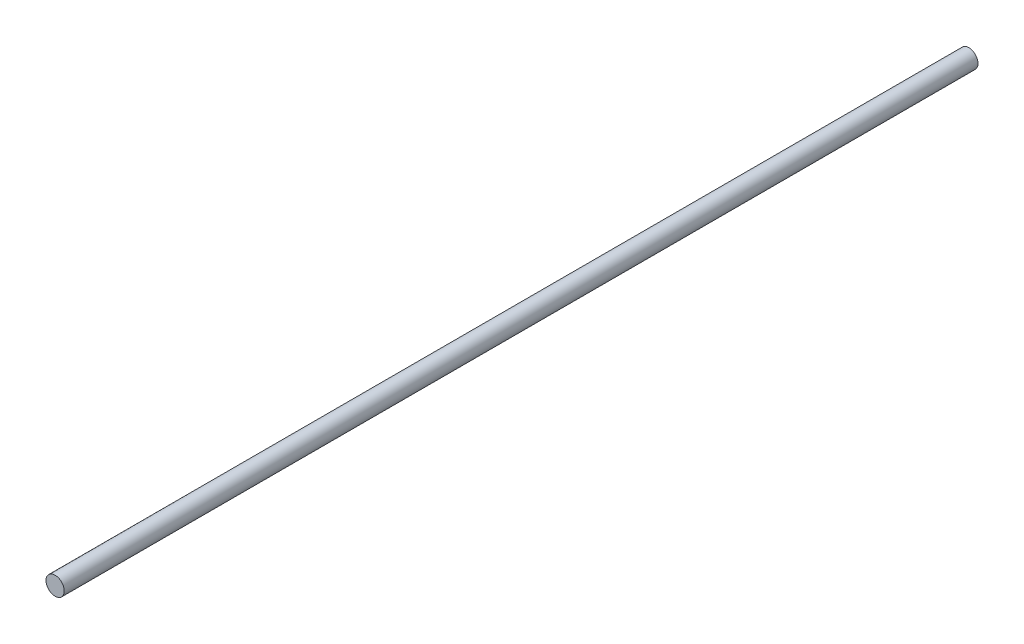
ISO-10303-21;
HEADER;
FILE_DESCRIPTION(('STEP AP214'),'2;1');
FILE_NAME('part.step','',(''),(''),'','','');
FILE_SCHEMA(('AUTOMOTIVE_DESIGN { 1 0 10303 214 1 1 1 1 }'));
ENDSEC;
DATA;
#1=APPLICATION_CONTEXT('core data for automotive mechanical design processes');
#2=APPLICATION_PROTOCOL_DEFINITION('international standard','automotive_design',2000,#1);
#3=PRODUCT_CONTEXT('',#1,'mechanical');
#4=PRODUCT('Part','Part','',(#3));
#5=PRODUCT_RELATED_PRODUCT_CATEGORY('part','',(#4));
#6=PRODUCT_DEFINITION_FORMATION('','',#4);
#7=PRODUCT_DEFINITION_CONTEXT('part definition',#1,'design');
#8=PRODUCT_DEFINITION('design','',#6,#7);
#9=PRODUCT_DEFINITION_SHAPE('','',#8);
#10=(LENGTH_UNIT() NAMED_UNIT(*) SI_UNIT(.MILLI.,.METRE.));
#11=(NAMED_UNIT(*) PLANE_ANGLE_UNIT() SI_UNIT($,.RADIAN.));
#12=(NAMED_UNIT(*) SI_UNIT($,.STERADIAN.) SOLID_ANGLE_UNIT());
#13=UNCERTAINTY_MEASURE_WITH_UNIT(LENGTH_MEASURE(1.E-05),#10,'distance_accuracy_value','');
#14=(GEOMETRIC_REPRESENTATION_CONTEXT(3) GLOBAL_UNCERTAINTY_ASSIGNED_CONTEXT((#13)) GLOBAL_UNIT_ASSIGNED_CONTEXT((#10,
#11,#12)) REPRESENTATION_CONTEXT('',''));
#15=CARTESIAN_POINT('',(0.,0.,0.));
#16=DIRECTION('',(0.,0.,1.));
#17=DIRECTION('',(1.,0.,0.));
#18=AXIS2_PLACEMENT_3D('',#15,#16,#17);
#19=CARTESIAN_POINT('',(0.,0.,150.));
#20=DIRECTION('',(0.,0.,-1.));
#21=DIRECTION('',(-1.,0.,0.));
#22=AXIS2_PLACEMENT_3D('',#19,#20,#21);
#23=CYLINDRICAL_SURFACE('',#22,1.5);
#24=CARTESIAN_POINT('',(0.,0.,150.));
#25=DIRECTION('',(0.,0.,1.));
#26=DIRECTION('',(1.,0.,0.));
#27=AXIS2_PLACEMENT_3D('',#24,#25,#26);
#28=CIRCLE('',#27,1.5);
#29=CARTESIAN_POINT('',(1.5,0.,150.));
#30=VERTEX_POINT('',#29);
#31=EDGE_CURVE('E10',#30,#30,#28,.T.);
#32=ORIENTED_EDGE('',*,*,#31,.F.);
#33=EDGE_LOOP('',(#32));
#34=FACE_BOUND('',#33,.T.);
#35=CARTESIAN_POINT('',(0.,0.,0.));
#36=DIRECTION('',(0.,0.,1.));
#37=DIRECTION('',(1.,0.,0.));
#38=AXIS2_PLACEMENT_3D('',#35,#36,#37);
#39=CIRCLE('',#38,1.5);
#40=CARTESIAN_POINT('',(1.5,0.,0.));
#41=VERTEX_POINT('',#40);
#42=EDGE_CURVE('E37',#41,#41,#39,.T.);
#43=ORIENTED_EDGE('',*,*,#42,.T.);
#44=EDGE_LOOP('',(#43));
#45=FACE_BOUND('',#44,.T.);
#46=ADVANCED_FACE('F34',(#34,#45),#23,.T.);
#47=CARTESIAN_POINT('',(0.,0.,150.));
#48=DIRECTION('',(0.,0.,1.));
#49=DIRECTION('',(1.,0.,0.));
#50=AXIS2_PLACEMENT_3D('',#47,#48,#49);
#51=PLANE('',#50);
#52=ORIENTED_EDGE('',*,*,#31,.T.);
#53=EDGE_LOOP('',(#52));
#54=FACE_BOUND('',#53,.T.);
#55=ADVANCED_FACE('F49',(#54),#51,.T.);
#56=CARTESIAN_POINT('',(0.,0.,0.));
#57=DIRECTION('',(0.,0.,1.));
#58=DIRECTION('',(1.,0.,0.));
#59=AXIS2_PLACEMENT_3D('',#56,#57,#58);
#60=PLANE('',#59);
#61=ORIENTED_EDGE('',*,*,#42,.F.);
#62=EDGE_LOOP('',(#61));
#63=FACE_BOUND('',#62,.T.);
#64=ADVANCED_FACE('F47',(#63),#60,.F.);
#65=CLOSED_SHELL('',(#46,#55,#64));
#66=MANIFOLD_SOLID_BREP('B2',#65);
#67=ADVANCED_BREP_SHAPE_REPRESENTATION('',(#18,#66),#14);
#68=SHAPE_DEFINITION_REPRESENTATION(#9,#67);
ENDSEC;
END-ISO-10303-21;
